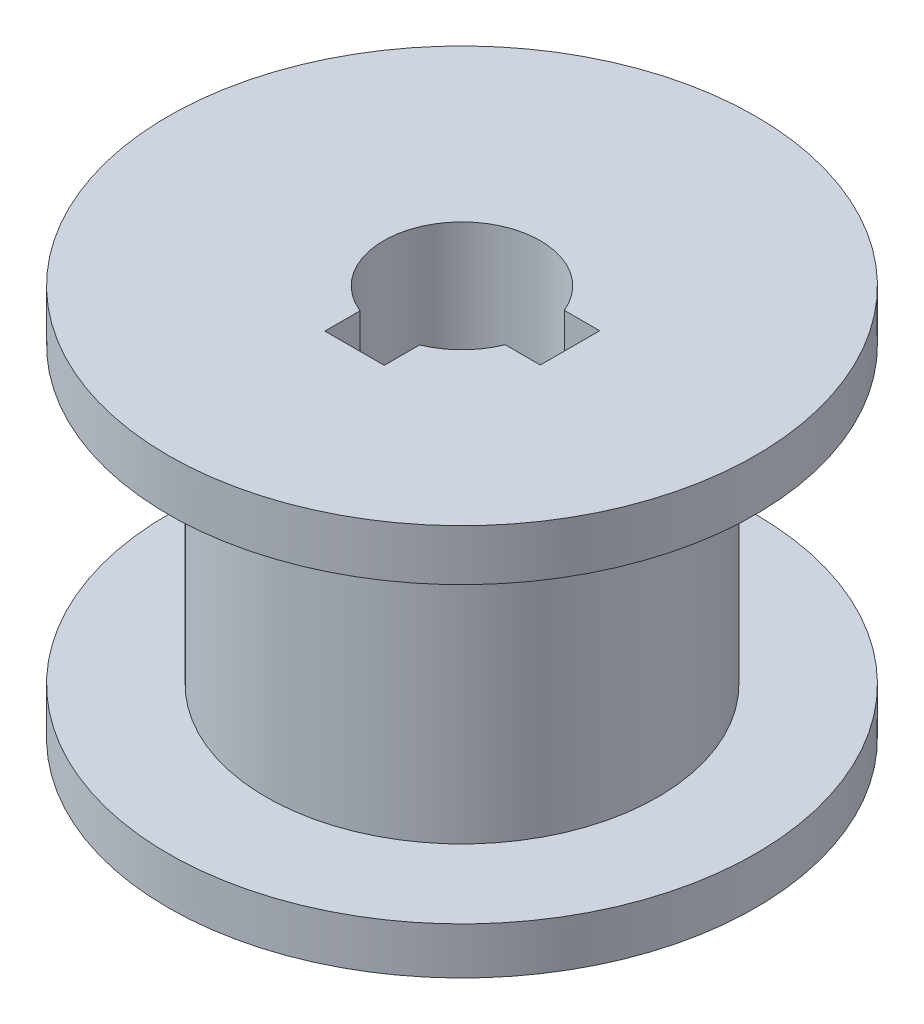
ISO-10303-21;
HEADER;
FILE_DESCRIPTION(('STEP AP214'),'2;1');
FILE_NAME('part.step','',(''),(''),'','','');
FILE_SCHEMA(('AUTOMOTIVE_DESIGN { 1 0 10303 214 1 1 1 1 }'));
ENDSEC;
DATA;
#1=APPLICATION_CONTEXT('core data for automotive mechanical design processes');
#2=APPLICATION_PROTOCOL_DEFINITION('international standard','automotive_design',2000,#1);
#3=PRODUCT_CONTEXT('',#1,'mechanical');
#4=PRODUCT('Part','Part','',(#3));
#5=PRODUCT_RELATED_PRODUCT_CATEGORY('part','',(#4));
#6=PRODUCT_DEFINITION_FORMATION('','',#4);
#7=PRODUCT_DEFINITION_CONTEXT('part definition',#1,'design');
#8=PRODUCT_DEFINITION('design','',#6,#7);
#9=PRODUCT_DEFINITION_SHAPE('','',#8);
#10=(LENGTH_UNIT() NAMED_UNIT(*) SI_UNIT(.MILLI.,.METRE.));
#11=(NAMED_UNIT(*) PLANE_ANGLE_UNIT() SI_UNIT($,.RADIAN.));
#12=(NAMED_UNIT(*) SI_UNIT($,.STERADIAN.) SOLID_ANGLE_UNIT());
#13=UNCERTAINTY_MEASURE_WITH_UNIT(LENGTH_MEASURE(1.E-05),#10,'distance_accuracy_value','');
#14=(GEOMETRIC_REPRESENTATION_CONTEXT(3) GLOBAL_UNCERTAINTY_ASSIGNED_CONTEXT((#13)) GLOBAL_UNIT_ASSIGNED_CONTEXT((#10,
#11,#12)) REPRESENTATION_CONTEXT('',''));
#15=CARTESIAN_POINT('',(0.,0.,0.));
#16=DIRECTION('',(0.,0.,1.));
#17=DIRECTION('',(1.,0.,0.));
#18=AXIS2_PLACEMENT_3D('',#15,#16,#17);
#19=CARTESIAN_POINT('',(0.,20.,0.));
#20=DIRECTION('',(0.,-1.,0.));
#21=DIRECTION('',(0.,0.,-1.));
#22=AXIS2_PLACEMENT_3D('',#19,#20,#21);
#23=CYLINDRICAL_SURFACE('',#22,15.);
#24=CARTESIAN_POINT('',(0.,17.3920213614737,0.));
#25=DIRECTION('',(0.,-1.,0.));
#26=DIRECTION('',(0.,0.,-1.));
#27=AXIS2_PLACEMENT_3D('',#24,#25,#26);
#28=CIRCLE('',#27,15.);
#29=CARTESIAN_POINT('',(0.,17.3920213614737,-15.));
#30=VERTEX_POINT('',#29);
#31=EDGE_CURVE('E192',#30,#30,#28,.T.);
#32=ORIENTED_EDGE('',*,*,#31,.F.);
#33=EDGE_LOOP('',(#32));
#34=FACE_BOUND('',#33,.T.);
#35=CARTESIAN_POINT('',(0.,20.,0.));
#36=DIRECTION('',(0.,1.,0.));
#37=DIRECTION('',(0.,0.,1.));
#38=AXIS2_PLACEMENT_3D('',#35,#36,#37);
#39=CIRCLE('',#38,15.);
#40=CARTESIAN_POINT('',(0.,20.,15.));
#41=VERTEX_POINT('',#40);
#42=EDGE_CURVE('E123',#41,#41,#39,.T.);
#43=ORIENTED_EDGE('',*,*,#42,.F.);
#44=EDGE_LOOP('',(#43));
#45=FACE_BOUND('',#44,.T.);
#46=ADVANCED_FACE('F32',(#34,#45),#23,.T.);
#47=CARTESIAN_POINT('',(0.,20.,0.));
#48=DIRECTION('',(0.,-1.,0.));
#49=DIRECTION('',(0.,0.,-1.));
#50=AXIS2_PLACEMENT_3D('',#47,#48,#49);
#51=CYLINDRICAL_SURFACE('',#50,4.);
#52=CARTESIAN_POINT('',(0.,0.,0.));
#53=DIRECTION('',(0.,1.,0.));
#54=DIRECTION('',(0.,0.,1.));
#55=AXIS2_PLACEMENT_3D('',#52,#53,#54);
#56=CIRCLE('',#55,4.);
#57=CARTESIAN_POINT('',(1.52999999999999,0.,3.69582196540905));
#58=VERTEX_POINT('',#57);
#59=CARTESIAN_POINT('',(3.70809924354783,0.,1.5));
#60=VERTEX_POINT('',#59);
#61=EDGE_CURVE('E129',#58,#60,#56,.T.);
#62=ORIENTED_EDGE('',*,*,#61,.F.);
#63=DIRECTION('',(0.,-1.,0.));
#64=VECTOR('',#63,1.);
#65=CARTESIAN_POINT('',(1.52999999999999,20.,3.69582196540905));
#66=LINE('',#65,#64);
#67=CARTESIAN_POINT('',(1.52999999999999,20.,3.69582196540905));
#68=VERTEX_POINT('',#67);
#69=EDGE_CURVE('E11',#68,#58,#66,.T.);
#70=ORIENTED_EDGE('',*,*,#69,.F.);
#71=CARTESIAN_POINT('',(0.,20.,0.));
#72=DIRECTION('',(0.,1.,0.));
#73=DIRECTION('',(0.,0.,1.));
#74=AXIS2_PLACEMENT_3D('',#71,#72,#73);
#75=CIRCLE('',#74,4.);
#76=CARTESIAN_POINT('',(3.70809924354783,20.,1.5));
#77=VERTEX_POINT('',#76);
#78=EDGE_CURVE('E151',#68,#77,#75,.T.);
#79=ORIENTED_EDGE('',*,*,#78,.T.);
#80=DIRECTION('',(0.,-1.,0.));
#81=VECTOR('',#80,1.);
#82=CARTESIAN_POINT('',(3.70809924354783,20.,1.5));
#83=LINE('',#82,#81);
#84=EDGE_CURVE('E83',#77,#60,#83,.T.);
#85=ORIENTED_EDGE('',*,*,#84,.T.);
#86=EDGE_LOOP('',(#62,#70,#79,#85));
#87=FACE_BOUND('',#86,.T.);
#88=ADVANCED_FACE('F200',(#87),#51,.F.);
#89=CARTESIAN_POINT('',(1.53,20.,0.));
#90=DIRECTION('',(-1.,0.,0.));
#91=DIRECTION('',(0.,0.,1.));
#92=AXIS2_PLACEMENT_3D('',#89,#90,#91);
#93=PLANE('',#92);
#94=DIRECTION('',(0.,0.,-1.));
#95=VECTOR('',#94,1.);
#96=CARTESIAN_POINT('',(1.53,0.,0.));
#97=LINE('',#96,#95);
#98=CARTESIAN_POINT('',(1.52999999999998,0.,5.50000000000001));
#99=VERTEX_POINT('',#98);
#100=EDGE_CURVE('E132',#99,#58,#97,.T.);
#101=ORIENTED_EDGE('',*,*,#100,.F.);
#102=DIRECTION('',(0.,-1.,0.));
#103=VECTOR('',#102,1.);
#104=CARTESIAN_POINT('',(1.52999999999998,20.,5.50000000000001));
#105=LINE('',#104,#103);
#106=CARTESIAN_POINT('',(1.52999999999998,20.,5.50000000000001));
#107=VERTEX_POINT('',#106);
#108=EDGE_CURVE('E41',#107,#99,#105,.T.);
#109=ORIENTED_EDGE('',*,*,#108,.F.);
#110=DIRECTION('',(0.,0.,-1.));
#111=VECTOR('',#110,1.);
#112=CARTESIAN_POINT('',(1.53,20.,0.));
#113=LINE('',#112,#111);
#114=EDGE_CURVE('E179',#107,#68,#113,.T.);
#115=ORIENTED_EDGE('',*,*,#114,.T.);
#116=ORIENTED_EDGE('',*,*,#69,.T.);
#117=EDGE_LOOP('',(#101,#109,#115,#116));
#118=FACE_BOUND('',#117,.T.);
#119=ADVANCED_FACE('F34',(#118),#93,.T.);
#120=CARTESIAN_POINT('',(0.,20.,5.5));
#121=DIRECTION('',(0.,0.,-1.));
#122=DIRECTION('',(-1.,0.,0.));
#123=AXIS2_PLACEMENT_3D('',#120,#121,#122);
#124=PLANE('',#123);
#125=DIRECTION('',(1.,0.,0.));
#126=VECTOR('',#125,1.);
#127=CARTESIAN_POINT('',(0.,0.,5.5));
#128=LINE('',#127,#126);
#129=CARTESIAN_POINT('',(-1.50000000000002,0.,5.5));
#130=VERTEX_POINT('',#129);
#131=EDGE_CURVE('E137',#130,#99,#128,.T.);
#132=ORIENTED_EDGE('',*,*,#131,.F.);
#133=DIRECTION('',(0.,-1.,0.));
#134=VECTOR('',#133,1.);
#135=CARTESIAN_POINT('',(-1.50000000000002,20.,5.5));
#136=LINE('',#135,#134);
#137=CARTESIAN_POINT('',(-1.50000000000002,20.,5.5));
#138=VERTEX_POINT('',#137);
#139=EDGE_CURVE('E157',#138,#130,#136,.T.);
#140=ORIENTED_EDGE('',*,*,#139,.F.);
#141=DIRECTION('',(1.,0.,0.));
#142=VECTOR('',#141,1.);
#143=CARTESIAN_POINT('',(0.,20.,5.5));
#144=LINE('',#143,#142);
#145=EDGE_CURVE('E164',#138,#107,#144,.T.);
#146=ORIENTED_EDGE('',*,*,#145,.T.);
#147=ORIENTED_EDGE('',*,*,#108,.T.);
#148=EDGE_LOOP('',(#132,#140,#146,#147));
#149=FACE_BOUND('',#148,.T.);
#150=ADVANCED_FACE('F162',(#149),#124,.T.);
#151=CARTESIAN_POINT('',(-1.5,20.,0.));
#152=DIRECTION('',(-1.,0.,0.));
#153=DIRECTION('',(0.,0.,1.));
#154=AXIS2_PLACEMENT_3D('',#151,#152,#153);
#155=PLANE('',#154);
#156=DIRECTION('',(0.,0.,-1.));
#157=VECTOR('',#156,1.);
#158=CARTESIAN_POINT('',(-1.5,0.,0.));
#159=LINE('',#158,#157);
#160=CARTESIAN_POINT('',(-1.50000000000001,0.,3.70809924354783));
#161=VERTEX_POINT('',#160);
#162=EDGE_CURVE('E140',#130,#161,#159,.T.);
#163=ORIENTED_EDGE('',*,*,#162,.T.);
#164=DIRECTION('',(0.,-1.,0.));
#165=VECTOR('',#164,1.);
#166=CARTESIAN_POINT('',(-1.50000000000001,20.,3.70809924354783));
#167=LINE('',#166,#165);
#168=CARTESIAN_POINT('',(-1.50000000000001,20.,3.70809924354783));
#169=VERTEX_POINT('',#168);
#170=EDGE_CURVE('E155',#169,#161,#167,.T.);
#171=ORIENTED_EDGE('',*,*,#170,.F.);
#172=DIRECTION('',(0.,0.,-1.));
#173=VECTOR('',#172,1.);
#174=CARTESIAN_POINT('',(-1.5,20.,0.));
#175=LINE('',#174,#173);
#176=EDGE_CURVE('E178',#138,#169,#175,.T.);
#177=ORIENTED_EDGE('',*,*,#176,.F.);
#178=ORIENTED_EDGE('',*,*,#139,.T.);
#179=EDGE_LOOP('',(#163,#171,#177,#178));
#180=FACE_BOUND('',#179,.T.);
#181=ADVANCED_FACE('F176',(#180),#155,.F.);
#182=CARTESIAN_POINT('',(3.69582196540905,0.,-1.53));
#183=VERTEX_POINT('',#182);
#184=EDGE_CURVE('E134',#183,#161,#56,.T.);
#185=ORIENTED_EDGE('',*,*,#184,.F.);
#186=DIRECTION('',(0.,-1.,0.));
#187=VECTOR('',#186,1.);
#188=CARTESIAN_POINT('',(3.69582196540905,20.,-1.53));
#189=LINE('',#188,#187);
#190=CARTESIAN_POINT('',(3.69582196540905,20.,-1.53));
#191=VERTEX_POINT('',#190);
#192=EDGE_CURVE('E112',#191,#183,#189,.T.);
#193=ORIENTED_EDGE('',*,*,#192,.F.);
#194=EDGE_CURVE('E119',#191,#169,#75,.T.);
#195=ORIENTED_EDGE('',*,*,#194,.T.);
#196=ORIENTED_EDGE('',*,*,#170,.T.);
#197=EDGE_LOOP('',(#185,#193,#195,#196));
#198=FACE_BOUND('',#197,.T.);
#199=ADVANCED_FACE('F222',(#198),#51,.F.);
#200=CARTESIAN_POINT('',(0.,20.,-1.53));
#201=DIRECTION('',(0.,0.,1.));
#202=DIRECTION('',(1.,0.,0.));
#203=AXIS2_PLACEMENT_3D('',#200,#201,#202);
#204=PLANE('',#203);
#205=DIRECTION('',(-1.,0.,0.));
#206=VECTOR('',#205,1.);
#207=CARTESIAN_POINT('',(0.,0.,-1.53));
#208=LINE('',#207,#206);
#209=CARTESIAN_POINT('',(5.5,0.,-1.53));
#210=VERTEX_POINT('',#209);
#211=EDGE_CURVE('E107',#210,#183,#208,.T.);
#212=ORIENTED_EDGE('',*,*,#211,.F.);
#213=DIRECTION('',(0.,-1.,0.));
#214=VECTOR('',#213,1.);
#215=CARTESIAN_POINT('',(5.5,20.,-1.53));
#216=LINE('',#215,#214);
#217=CARTESIAN_POINT('',(5.5,20.,-1.53));
#218=VERTEX_POINT('',#217);
#219=EDGE_CURVE('E102',#218,#210,#216,.T.);
#220=ORIENTED_EDGE('',*,*,#219,.F.);
#221=DIRECTION('',(-1.,0.,0.));
#222=VECTOR('',#221,1.);
#223=CARTESIAN_POINT('',(0.,20.,-1.53));
#224=LINE('',#223,#222);
#225=EDGE_CURVE('E105',#218,#191,#224,.T.);
#226=ORIENTED_EDGE('',*,*,#225,.T.);
#227=ORIENTED_EDGE('',*,*,#192,.T.);
#228=EDGE_LOOP('',(#212,#220,#226,#227));
#229=FACE_BOUND('',#228,.T.);
#230=ADVANCED_FACE('F104',(#229),#204,.T.);
#231=CARTESIAN_POINT('',(5.5,20.,0.));
#232=DIRECTION('',(-1.,0.,0.));
#233=DIRECTION('',(0.,0.,1.));
#234=AXIS2_PLACEMENT_3D('',#231,#232,#233);
#235=PLANE('',#234);
#236=DIRECTION('',(0.,0.,-1.));
#237=VECTOR('',#236,1.);
#238=CARTESIAN_POINT('',(5.5,0.,0.));
#239=LINE('',#238,#237);
#240=CARTESIAN_POINT('',(5.5,0.,1.5));
#241=VERTEX_POINT('',#240);
#242=EDGE_CURVE('E144',#241,#210,#239,.T.);
#243=ORIENTED_EDGE('',*,*,#242,.F.);
#244=DIRECTION('',(0.,-1.,0.));
#245=VECTOR('',#244,1.);
#246=CARTESIAN_POINT('',(5.5,20.,1.5));
#247=LINE('',#246,#245);
#248=CARTESIAN_POINT('',(5.5,20.,1.5));
#249=VERTEX_POINT('',#248);
#250=EDGE_CURVE('E76',#249,#241,#247,.T.);
#251=ORIENTED_EDGE('',*,*,#250,.F.);
#252=DIRECTION('',(0.,0.,-1.));
#253=VECTOR('',#252,1.);
#254=CARTESIAN_POINT('',(5.5,20.,0.));
#255=LINE('',#254,#253);
#256=EDGE_CURVE('E117',#249,#218,#255,.T.);
#257=ORIENTED_EDGE('',*,*,#256,.T.);
#258=ORIENTED_EDGE('',*,*,#219,.T.);
#259=EDGE_LOOP('',(#243,#251,#257,#258));
#260=FACE_BOUND('',#259,.T.);
#261=ADVANCED_FACE('F121',(#260),#235,.T.);
#262=CARTESIAN_POINT('',(0.,20.,1.5));
#263=DIRECTION('',(0.,0.,1.));
#264=DIRECTION('',(1.,0.,0.));
#265=AXIS2_PLACEMENT_3D('',#262,#263,#264);
#266=PLANE('',#265);
#267=DIRECTION('',(-1.,0.,0.));
#268=VECTOR('',#267,1.);
#269=CARTESIAN_POINT('',(0.,0.,1.5));
#270=LINE('',#269,#268);
#271=EDGE_CURVE('E146',#241,#60,#270,.T.);
#272=ORIENTED_EDGE('',*,*,#271,.T.);
#273=ORIENTED_EDGE('',*,*,#84,.F.);
#274=DIRECTION('',(-1.,0.,0.));
#275=VECTOR('',#274,1.);
#276=CARTESIAN_POINT('',(0.,20.,1.5));
#277=LINE('',#276,#275);
#278=EDGE_CURVE('E49',#249,#77,#277,.T.);
#279=ORIENTED_EDGE('',*,*,#278,.F.);
#280=ORIENTED_EDGE('',*,*,#250,.T.);
#281=EDGE_LOOP('',(#272,#273,#279,#280));
#282=FACE_BOUND('',#281,.T.);
#283=ADVANCED_FACE('F211',(#282),#266,.F.);
#284=CARTESIAN_POINT('',(0.,2.39202136147373,0.));
#285=DIRECTION('',(0.,-1.,0.));
#286=DIRECTION('',(0.,0.,-1.));
#287=AXIS2_PLACEMENT_3D('',#284,#285,#286);
#288=CIRCLE('',#287,15.);
#289=CARTESIAN_POINT('',(0.,2.39202136147373,-15.));
#290=VERTEX_POINT('',#289);
#291=EDGE_CURVE('E189',#290,#290,#288,.T.);
#292=ORIENTED_EDGE('',*,*,#291,.T.);
#293=EDGE_LOOP('',(#292));
#294=FACE_BOUND('',#293,.T.);
#295=CARTESIAN_POINT('',(0.,0.,0.));
#296=DIRECTION('',(0.,1.,0.));
#297=DIRECTION('',(0.,0.,1.));
#298=AXIS2_PLACEMENT_3D('',#295,#296,#297);
#299=CIRCLE('',#298,15.);
#300=CARTESIAN_POINT('',(0.,0.,15.));
#301=VERTEX_POINT('',#300);
#302=EDGE_CURVE('E148',#301,#301,#299,.T.);
#303=ORIENTED_EDGE('',*,*,#302,.T.);
#304=EDGE_LOOP('',(#303));
#305=FACE_BOUND('',#304,.T.);
#306=ADVANCED_FACE('F202',(#294,#305),#23,.T.);
#307=CARTESIAN_POINT('',(0.,20.,0.));
#308=DIRECTION('',(0.,1.,0.));
#309=DIRECTION('',(0.,0.,1.));
#310=AXIS2_PLACEMENT_3D('',#307,#308,#309);
#311=PLANE('',#310);
#312=ORIENTED_EDGE('',*,*,#78,.F.);
#313=ORIENTED_EDGE('',*,*,#114,.F.);
#314=ORIENTED_EDGE('',*,*,#145,.F.);
#315=ORIENTED_EDGE('',*,*,#176,.T.);
#316=ORIENTED_EDGE('',*,*,#194,.F.);
#317=ORIENTED_EDGE('',*,*,#225,.F.);
#318=ORIENTED_EDGE('',*,*,#256,.F.);
#319=ORIENTED_EDGE('',*,*,#278,.T.);
#320=EDGE_LOOP('',(#312,#313,#314,#315,#316,#317,#318,#319));
#321=FACE_BOUND('',#320,.T.);
#322=ORIENTED_EDGE('',*,*,#42,.T.);
#323=EDGE_LOOP('',(#322));
#324=FACE_BOUND('',#323,.T.);
#325=ADVANCED_FACE('F115',(#321,#324),#311,.T.);
#326=CARTESIAN_POINT('',(0.,0.,0.));
#327=DIRECTION('',(0.,1.,0.));
#328=DIRECTION('',(0.,0.,1.));
#329=AXIS2_PLACEMENT_3D('',#326,#327,#328);
#330=PLANE('',#329);
#331=ORIENTED_EDGE('',*,*,#61,.T.);
#332=ORIENTED_EDGE('',*,*,#271,.F.);
#333=ORIENTED_EDGE('',*,*,#242,.T.);
#334=ORIENTED_EDGE('',*,*,#211,.T.);
#335=ORIENTED_EDGE('',*,*,#184,.T.);
#336=ORIENTED_EDGE('',*,*,#162,.F.);
#337=ORIENTED_EDGE('',*,*,#131,.T.);
#338=ORIENTED_EDGE('',*,*,#100,.T.);
#339=EDGE_LOOP('',(#331,#332,#333,#334,#335,#336,#337,#338));
#340=FACE_BOUND('',#339,.T.);
#341=ORIENTED_EDGE('',*,*,#302,.F.);
#342=EDGE_LOOP('',(#341));
#343=FACE_BOUND('',#342,.T.);
#344=ADVANCED_FACE('F170',(#340,#343),#330,.F.);
#345=CARTESIAN_POINT('',(15.,17.3920213614737,0.));
#346=DIRECTION('',(0.,1.,0.));
#347=DIRECTION('',(0.,0.,1.));
#348=AXIS2_PLACEMENT_3D('',#345,#346,#347);
#349=PLANE('',#348);
#350=CARTESIAN_POINT('',(0.,17.3920213614737,0.));
#351=DIRECTION('',(0.,-1.,0.));
#352=DIRECTION('',(0.,0.,-1.));
#353=AXIS2_PLACEMENT_3D('',#350,#351,#352);
#354=CIRCLE('',#353,10.);
#355=CARTESIAN_POINT('',(0.,17.3920213614737,-10.));
#356=VERTEX_POINT('',#355);
#357=EDGE_CURVE('E133',#356,#356,#354,.T.);
#358=ORIENTED_EDGE('',*,*,#357,.F.);
#359=EDGE_LOOP('',(#358));
#360=FACE_BOUND('',#359,.T.);
#361=ORIENTED_EDGE('',*,*,#31,.T.);
#362=EDGE_LOOP('',(#361));
#363=FACE_BOUND('',#362,.T.);
#364=ADVANCED_FACE('F196',(#360,#363),#349,.F.);
#365=CARTESIAN_POINT('',(0.,0.,0.));
#366=DIRECTION('',(0.,-1.,0.));
#367=DIRECTION('',(0.,0.,-1.));
#368=AXIS2_PLACEMENT_3D('',#365,#366,#367);
#369=CYLINDRICAL_SURFACE('',#368,10.);
#370=CARTESIAN_POINT('',(0.,2.39202136147373,0.));
#371=DIRECTION('',(0.,-1.,0.));
#372=DIRECTION('',(0.,0.,-1.));
#373=AXIS2_PLACEMENT_3D('',#370,#371,#372);
#374=CIRCLE('',#373,10.);
#375=CARTESIAN_POINT('',(0.,2.39202136147373,-10.));
#376=VERTEX_POINT('',#375);
#377=EDGE_CURVE('E186',#376,#376,#374,.T.);
#378=ORIENTED_EDGE('',*,*,#377,.F.);
#379=EDGE_LOOP('',(#378));
#380=FACE_BOUND('',#379,.T.);
#381=ORIENTED_EDGE('',*,*,#357,.T.);
#382=EDGE_LOOP('',(#381));
#383=FACE_BOUND('',#382,.T.);
#384=ADVANCED_FACE('F260',(#380,#383),#369,.T.);
#385=CARTESIAN_POINT('',(10.,2.39202136147373,0.));
#386=DIRECTION('',(0.,-1.,0.));
#387=DIRECTION('',(0.,0.,-1.));
#388=AXIS2_PLACEMENT_3D('',#385,#386,#387);
#389=PLANE('',#388);
#390=ORIENTED_EDGE('',*,*,#291,.F.);
#391=EDGE_LOOP('',(#390));
#392=FACE_BOUND('',#391,.T.);
#393=ORIENTED_EDGE('',*,*,#377,.T.);
#394=EDGE_LOOP('',(#393));
#395=FACE_BOUND('',#394,.T.);
#396=ADVANCED_FACE('F269',(#392,#395),#389,.F.);
#397=CLOSED_SHELL('',(#46,#88,#119,#150,#181,#199,#230,#261,#283,#306,#325,#344,#364,#384,#396));
#398=MANIFOLD_SOLID_BREP('B2',#397);
#399=ADVANCED_BREP_SHAPE_REPRESENTATION('',(#18,#398),#14);
#400=SHAPE_DEFINITION_REPRESENTATION(#9,#399);
ENDSEC;
END-ISO-10303-21;
